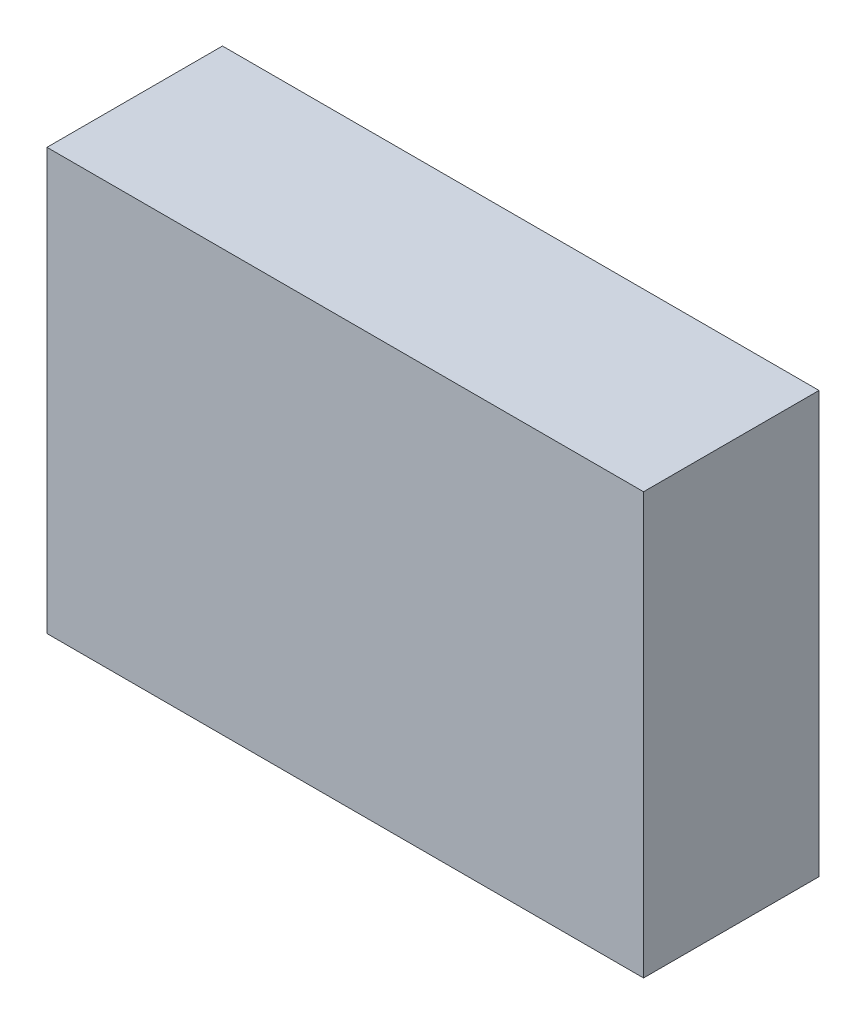
ISO-10303-21;
HEADER;
FILE_DESCRIPTION(('STEP AP214'),'2;1');
FILE_NAME('part.step','',(''),(''),'','','');
FILE_SCHEMA(('AUTOMOTIVE_DESIGN { 1 0 10303 214 1 1 1 1 }'));
ENDSEC;
DATA;
#1=APPLICATION_CONTEXT('core data for automotive mechanical design processes');
#2=APPLICATION_PROTOCOL_DEFINITION('international standard','automotive_design',2000,#1);
#3=PRODUCT_CONTEXT('',#1,'mechanical');
#4=PRODUCT('Part','Part','',(#3));
#5=PRODUCT_RELATED_PRODUCT_CATEGORY('part','',(#4));
#6=PRODUCT_DEFINITION_FORMATION('','',#4);
#7=PRODUCT_DEFINITION_CONTEXT('part definition',#1,'design');
#8=PRODUCT_DEFINITION('design','',#6,#7);
#9=PRODUCT_DEFINITION_SHAPE('','',#8);
#10=(LENGTH_UNIT() NAMED_UNIT(*) SI_UNIT(.MILLI.,.METRE.));
#11=(NAMED_UNIT(*) PLANE_ANGLE_UNIT() SI_UNIT($,.RADIAN.));
#12=(NAMED_UNIT(*) SI_UNIT($,.STERADIAN.) SOLID_ANGLE_UNIT());
#13=UNCERTAINTY_MEASURE_WITH_UNIT(LENGTH_MEASURE(1.E-05),#10,'distance_accuracy_value','');
#14=(GEOMETRIC_REPRESENTATION_CONTEXT(3) GLOBAL_UNCERTAINTY_ASSIGNED_CONTEXT((#13)) GLOBAL_UNIT_ASSIGNED_CONTEXT((#10,
#11,#12)) REPRESENTATION_CONTEXT('',''));
#15=CARTESIAN_POINT('',(0.,0.,0.));
#16=DIRECTION('',(0.,0.,1.));
#17=DIRECTION('',(1.,0.,0.));
#18=AXIS2_PLACEMENT_3D('',#15,#16,#17);
#19=CARTESIAN_POINT('',(-2.92,-1.87,0.));
#20=DIRECTION('',(1.,0.,0.));
#21=DIRECTION('',(0.,0.,1.));
#22=AXIS2_PLACEMENT_3D('',#19,#20,#21);
#23=PLANE('',#22);
#24=DIRECTION('',(0.,1.,0.));
#25=VECTOR('',#24,1.);
#26=CARTESIAN_POINT('',(-2.92,-1.87,0.1));
#27=LINE('',#26,#25);
#28=CARTESIAN_POINT('',(-2.92,-1.87,0.1));
#29=VERTEX_POINT('',#28);
#30=CARTESIAN_POINT('',(-2.92,-1.63,0.1));
#31=VERTEX_POINT('',#30);
#32=EDGE_CURVE('E11',#29,#31,#27,.T.);
#33=ORIENTED_EDGE('',*,*,#32,.T.);
#34=DIRECTION('',(0.,0.,1.));
#35=VECTOR('',#34,1.);
#36=CARTESIAN_POINT('',(-2.92,-1.63,0.));
#37=LINE('',#36,#35);
#38=CARTESIAN_POINT('',(-2.92,-1.63,0.));
#39=VERTEX_POINT('',#38);
#40=EDGE_CURVE('E24',#39,#31,#37,.T.);
#41=ORIENTED_EDGE('',*,*,#40,.F.);
#42=DIRECTION('',(0.,1.,0.));
#43=VECTOR('',#42,1.);
#44=CARTESIAN_POINT('',(-2.92,-1.87,0.));
#45=LINE('',#44,#43);
#46=CARTESIAN_POINT('',(-2.92,-1.87,0.));
#47=VERTEX_POINT('',#46);
#48=EDGE_CURVE('E86',#47,#39,#45,.T.);
#49=ORIENTED_EDGE('',*,*,#48,.F.);
#50=DIRECTION('',(0.,0.,1.));
#51=VECTOR('',#50,1.);
#52=CARTESIAN_POINT('',(-2.92,-1.87,0.));
#53=LINE('',#52,#51);
#54=EDGE_CURVE('E36',#47,#29,#53,.T.);
#55=ORIENTED_EDGE('',*,*,#54,.T.);
#56=EDGE_LOOP('',(#33,#41,#49,#55));
#57=FACE_BOUND('',#56,.T.);
#58=ADVANCED_FACE('F17',(#57),#23,.F.);
#59=CARTESIAN_POINT('',(-2.58,-1.87,0.));
#60=DIRECTION('',(1.,0.,0.));
#61=DIRECTION('',(0.,0.,1.));
#62=AXIS2_PLACEMENT_3D('',#59,#60,#61);
#63=PLANE('',#62);
#64=DIRECTION('',(0.,0.,1.));
#65=VECTOR('',#64,1.);
#66=CARTESIAN_POINT('',(-2.58,-1.87,0.));
#67=LINE('',#66,#65);
#68=CARTESIAN_POINT('',(-2.58,-1.87,0.));
#69=VERTEX_POINT('',#68);
#70=CARTESIAN_POINT('',(-2.58,-1.87,0.1));
#71=VERTEX_POINT('',#70);
#72=EDGE_CURVE('E83',#69,#71,#67,.T.);
#73=ORIENTED_EDGE('',*,*,#72,.F.);
#74=DIRECTION('',(0.,1.,0.));
#75=VECTOR('',#74,1.);
#76=CARTESIAN_POINT('',(-2.58,-1.87,0.));
#77=LINE('',#76,#75);
#78=CARTESIAN_POINT('',(-2.58,-1.63,0.));
#79=VERTEX_POINT('',#78);
#80=EDGE_CURVE('E63',#69,#79,#77,.T.);
#81=ORIENTED_EDGE('',*,*,#80,.T.);
#82=DIRECTION('',(0.,0.,1.));
#83=VECTOR('',#82,1.);
#84=CARTESIAN_POINT('',(-2.58,-1.63,0.));
#85=LINE('',#84,#83);
#86=CARTESIAN_POINT('',(-2.58,-1.63,0.1));
#87=VERTEX_POINT('',#86);
#88=EDGE_CURVE('E57',#79,#87,#85,.T.);
#89=ORIENTED_EDGE('',*,*,#88,.T.);
#90=DIRECTION('',(0.,1.,0.));
#91=VECTOR('',#90,1.);
#92=CARTESIAN_POINT('',(-2.58,-1.87,0.1));
#93=LINE('',#92,#91);
#94=EDGE_CURVE('E60',#71,#87,#93,.T.);
#95=ORIENTED_EDGE('',*,*,#94,.F.);
#96=EDGE_LOOP('',(#73,#81,#89,#95));
#97=FACE_BOUND('',#96,.T.);
#98=ADVANCED_FACE('F59',(#97),#63,.T.);
#99=CARTESIAN_POINT('',(-2.92,-1.87,0.));
#100=DIRECTION('',(0.,1.,0.));
#101=DIRECTION('',(0.,0.,1.));
#102=AXIS2_PLACEMENT_3D('',#99,#100,#101);
#103=PLANE('',#102);
#104=ORIENTED_EDGE('',*,*,#72,.T.);
#105=DIRECTION('',(1.,0.,0.));
#106=VECTOR('',#105,1.);
#107=CARTESIAN_POINT('',(-2.92,-1.87,0.1));
#108=LINE('',#107,#106);
#109=EDGE_CURVE('E71',#29,#71,#108,.T.);
#110=ORIENTED_EDGE('',*,*,#109,.F.);
#111=ORIENTED_EDGE('',*,*,#54,.F.);
#112=DIRECTION('',(1.,0.,0.));
#113=VECTOR('',#112,1.);
#114=CARTESIAN_POINT('',(-2.92,-1.87,0.));
#115=LINE('',#114,#113);
#116=EDGE_CURVE('E76',#47,#69,#115,.T.);
#117=ORIENTED_EDGE('',*,*,#116,.T.);
#118=EDGE_LOOP('',(#104,#110,#111,#117));
#119=FACE_BOUND('',#118,.T.);
#120=ADVANCED_FACE('F91',(#119),#103,.F.);
#121=CARTESIAN_POINT('',(-2.92,-1.63,0.));
#122=DIRECTION('',(0.,1.,0.));
#123=DIRECTION('',(0.,0.,1.));
#124=AXIS2_PLACEMENT_3D('',#121,#122,#123);
#125=PLANE('',#124);
#126=DIRECTION('',(1.,0.,0.));
#127=VECTOR('',#126,1.);
#128=CARTESIAN_POINT('',(-2.92,-1.63,0.));
#129=LINE('',#128,#127);
#130=EDGE_CURVE('E74',#39,#79,#129,.T.);
#131=ORIENTED_EDGE('',*,*,#130,.F.);
#132=ORIENTED_EDGE('',*,*,#40,.T.);
#133=DIRECTION('',(1.,0.,0.));
#134=VECTOR('',#133,1.);
#135=CARTESIAN_POINT('',(-2.92,-1.63,0.1));
#136=LINE('',#135,#134);
#137=EDGE_CURVE('E69',#31,#87,#136,.T.);
#138=ORIENTED_EDGE('',*,*,#137,.T.);
#139=ORIENTED_EDGE('',*,*,#88,.F.);
#140=EDGE_LOOP('',(#131,#132,#138,#139));
#141=FACE_BOUND('',#140,.T.);
#142=ADVANCED_FACE('F73',(#141),#125,.T.);
#143=CARTESIAN_POINT('',(-2.92,-1.87,0.));
#144=DIRECTION('',(0.,0.,1.));
#145=DIRECTION('',(1.,0.,0.));
#146=AXIS2_PLACEMENT_3D('',#143,#144,#145);
#147=PLANE('',#146);
#148=ORIENTED_EDGE('',*,*,#130,.T.);
#149=ORIENTED_EDGE('',*,*,#80,.F.);
#150=ORIENTED_EDGE('',*,*,#116,.F.);
#151=ORIENTED_EDGE('',*,*,#48,.T.);
#152=EDGE_LOOP('',(#148,#149,#150,#151));
#153=FACE_BOUND('',#152,.T.);
#154=ADVANCED_FACE('F89',(#153),#147,.F.);
#155=CARTESIAN_POINT('',(-2.92,-1.87,0.1));
#156=DIRECTION('',(0.,0.,1.));
#157=DIRECTION('',(1.,0.,0.));
#158=AXIS2_PLACEMENT_3D('',#155,#156,#157);
#159=PLANE('',#158);
#160=ORIENTED_EDGE('',*,*,#32,.F.);
#161=ORIENTED_EDGE('',*,*,#109,.T.);
#162=ORIENTED_EDGE('',*,*,#94,.T.);
#163=ORIENTED_EDGE('',*,*,#137,.F.);
#164=EDGE_LOOP('',(#160,#161,#162,#163));
#165=FACE_BOUND('',#164,.T.);
#166=ADVANCED_FACE('F68',(#165),#159,.T.);
#167=CLOSED_SHELL('',(#58,#98,#120,#142,#154,#166));
#168=MANIFOLD_SOLID_BREP('B1',#167);
#169=ADVANCED_BREP_SHAPE_REPRESENTATION('',(#18,#168),#14);
#170=SHAPE_DEFINITION_REPRESENTATION(#9,#169);
ENDSEC;
END-ISO-10303-21;
